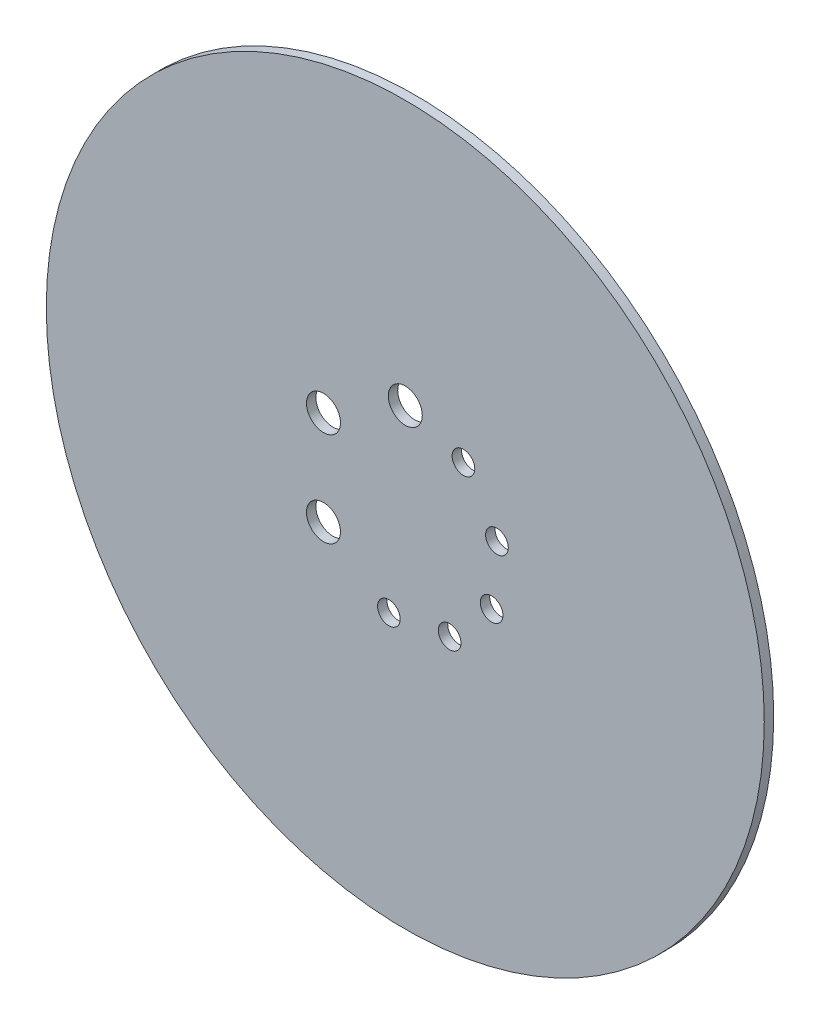
ISO-10303-21;
HEADER;
FILE_DESCRIPTION(('STEP AP214'),'2;1');
FILE_NAME('part.step','',(''),(''),'','','');
FILE_SCHEMA(('AUTOMOTIVE_DESIGN { 1 0 10303 214 1 1 1 1 }'));
ENDSEC;
DATA;
#1=APPLICATION_CONTEXT('core data for automotive mechanical design processes');
#2=APPLICATION_PROTOCOL_DEFINITION('international standard','automotive_design',2000,#1);
#3=PRODUCT_CONTEXT('',#1,'mechanical');
#4=PRODUCT('Part','Part','',(#3));
#5=PRODUCT_RELATED_PRODUCT_CATEGORY('part','',(#4));
#6=PRODUCT_DEFINITION_FORMATION('','',#4);
#7=PRODUCT_DEFINITION_CONTEXT('part definition',#1,'design');
#8=PRODUCT_DEFINITION('design','',#6,#7);
#9=PRODUCT_DEFINITION_SHAPE('','',#8);
#10=(LENGTH_UNIT() NAMED_UNIT(*) SI_UNIT(.MILLI.,.METRE.));
#11=(NAMED_UNIT(*) PLANE_ANGLE_UNIT() SI_UNIT($,.RADIAN.));
#12=(NAMED_UNIT(*) SI_UNIT($,.STERADIAN.) SOLID_ANGLE_UNIT());
#13=UNCERTAINTY_MEASURE_WITH_UNIT(LENGTH_MEASURE(1.E-05),#10,'distance_accuracy_value','');
#14=(GEOMETRIC_REPRESENTATION_CONTEXT(3) GLOBAL_UNCERTAINTY_ASSIGNED_CONTEXT((#13)) GLOBAL_UNIT_ASSIGNED_CONTEXT((#10,
#11,#12)) REPRESENTATION_CONTEXT('',''));
#15=CARTESIAN_POINT('',(0.,0.,0.));
#16=DIRECTION('',(0.,0.,1.));
#17=DIRECTION('',(1.,0.,0.));
#18=AXIS2_PLACEMENT_3D('',#15,#16,#17);
#19=CARTESIAN_POINT('',(0.,0.,5.));
#20=DIRECTION('',(0.,0.,-1.));
#21=DIRECTION('',(-1.,0.,0.));
#22=AXIS2_PLACEMENT_3D('',#19,#20,#21);
#23=CYLINDRICAL_SURFACE('',#22,190.);
#24=CARTESIAN_POINT('',(0.,0.,5.));
#25=DIRECTION('',(0.,0.,1.));
#26=DIRECTION('',(1.,0.,0.));
#27=AXIS2_PLACEMENT_3D('',#24,#25,#26);
#28=CIRCLE('',#27,190.);
#29=CARTESIAN_POINT('',(190.,0.,5.));
#30=VERTEX_POINT('',#29);
#31=EDGE_CURVE('E10',#30,#30,#28,.T.);
#32=ORIENTED_EDGE('',*,*,#31,.F.);
#33=EDGE_LOOP('',(#32));
#34=FACE_BOUND('',#33,.T.);
#35=CARTESIAN_POINT('',(0.,0.,0.));
#36=DIRECTION('',(0.,0.,1.));
#37=DIRECTION('',(1.,0.,0.));
#38=AXIS2_PLACEMENT_3D('',#35,#36,#37);
#39=CIRCLE('',#38,190.);
#40=CARTESIAN_POINT('',(190.,0.,0.));
#41=VERTEX_POINT('',#40);
#42=EDGE_CURVE('E40',#41,#41,#39,.T.);
#43=ORIENTED_EDGE('',*,*,#42,.T.);
#44=EDGE_LOOP('',(#43));
#45=FACE_BOUND('',#44,.T.);
#46=ADVANCED_FACE('F37',(#34,#45),#23,.T.);
#47=CARTESIAN_POINT('',(0.,0.,5.));
#48=DIRECTION('',(0.,0.,1.));
#49=DIRECTION('',(1.,0.,0.));
#50=AXIS2_PLACEMENT_3D('',#47,#48,#49);
#51=PLANE('',#50);
#52=CARTESIAN_POINT('',(-43.3012701892218,25.0000000000002,5.));
#53=DIRECTION('',(0.,0.,1.));
#54=DIRECTION('',(1.,0.,0.));
#55=AXIS2_PLACEMENT_3D('',#52,#53,#54);
#56=CIRCLE('',#55,9.00000000000001);
#57=CARTESIAN_POINT('',(-34.3012701892218,25.0000000000002,5.));
#58=VERTEX_POINT('',#57);
#59=EDGE_CURVE('E47',#58,#58,#56,.T.);
#60=ORIENTED_EDGE('',*,*,#59,.F.);
#61=EDGE_LOOP('',(#60));
#62=FACE_BOUND('',#61,.T.);
#63=CARTESIAN_POINT('',(-43.301270189222,-24.9999999999999,5.));
#64=DIRECTION('',(0.,0.,1.));
#65=DIRECTION('',(1.,0.,0.));
#66=AXIS2_PLACEMENT_3D('',#63,#64,#65);
#67=CIRCLE('',#66,9.);
#68=CARTESIAN_POINT('',(-34.301270189222,-24.9999999999999,5.));
#69=VERTEX_POINT('',#68);
#70=EDGE_CURVE('E51',#69,#69,#67,.T.);
#71=ORIENTED_EDGE('',*,*,#70,.F.);
#72=EDGE_LOOP('',(#71));
#73=FACE_BOUND('',#72,.T.);
#74=CARTESIAN_POINT('',(30.7830737662827,39.4005376803363,5.));
#75=DIRECTION('',(0.,0.,1.));
#76=DIRECTION('',(1.,0.,0.));
#77=AXIS2_PLACEMENT_3D('',#74,#75,#76);
#78=CIRCLE('',#77,5.99999999999999);
#79=CARTESIAN_POINT('',(36.7830737662827,39.4005376803363,5.));
#80=VERTEX_POINT('',#79);
#81=EDGE_CURVE('E55',#80,#80,#78,.T.);
#82=ORIENTED_EDGE('',*,*,#81,.F.);
#83=EDGE_LOOP('',(#82));
#84=FACE_BOUND('',#83,.T.);
#85=CARTESIAN_POINT('',(48.5147863137998,12.0960947799836,5.));
#86=DIRECTION('',(0.,0.,1.));
#87=DIRECTION('',(1.,0.,0.));
#88=AXIS2_PLACEMENT_3D('',#85,#86,#87);
#89=CIRCLE('',#88,5.99999999999999);
#90=CARTESIAN_POINT('',(54.5147863137998,12.0960947799836,5.));
#91=VERTEX_POINT('',#90);
#92=EDGE_CURVE('E58',#91,#91,#89,.T.);
#93=ORIENTED_EDGE('',*,*,#92,.F.);
#94=EDGE_LOOP('',(#93));
#95=FACE_BOUND('',#94,.T.);
#96=CARTESIAN_POINT('',(45.6772728821301,-20.3368321537899,5.));
#97=DIRECTION('',(0.,0.,1.));
#98=DIRECTION('',(1.,0.,0.));
#99=AXIS2_PLACEMENT_3D('',#96,#97,#98);
#100=CIRCLE('',#99,5.99999999999999);
#101=CARTESIAN_POINT('',(51.6772728821301,-20.3368321537899,5.));
#102=VERTEX_POINT('',#101);
#103=EDGE_CURVE('E61',#102,#102,#100,.T.);
#104=ORIENTED_EDGE('',*,*,#103,.F.);
#105=EDGE_LOOP('',(#104));
#106=FACE_BOUND('',#105,.T.);
#107=CARTESIAN_POINT('',(23.4735781392946,-44.1473796429463,5.));
#108=DIRECTION('',(0.,0.,1.));
#109=DIRECTION('',(1.,0.,0.));
#110=AXIS2_PLACEMENT_3D('',#107,#108,#109);
#111=CIRCLE('',#110,6.);
#112=CARTESIAN_POINT('',(29.4735781392946,-44.1473796429463,5.));
#113=VERTEX_POINT('',#112);
#114=EDGE_CURVE('E64',#113,#113,#111,.T.);
#115=ORIENTED_EDGE('',*,*,#114,.F.);
#116=EDGE_LOOP('',(#115));
#117=FACE_BOUND('',#116,.T.);
#118=CARTESIAN_POINT('',(-8.68240888334655,-49.2403876506104,5.));
#119=DIRECTION('',(0.,0.,1.));
#120=DIRECTION('',(1.,0.,0.));
#121=AXIS2_PLACEMENT_3D('',#118,#119,#120);
#122=CIRCLE('',#121,5.99999999999999);
#123=CARTESIAN_POINT('',(-2.68240888334656,-49.2403876506104,5.));
#124=VERTEX_POINT('',#123);
#125=EDGE_CURVE('E67',#124,#124,#122,.T.);
#126=ORIENTED_EDGE('',*,*,#125,.F.);
#127=EDGE_LOOP('',(#126));
#128=FACE_BOUND('',#127,.T.);
#129=CARTESIAN_POINT('',(0.,50.,5.));
#130=DIRECTION('',(0.,0.,1.));
#131=DIRECTION('',(1.,0.,0.));
#132=AXIS2_PLACEMENT_3D('',#129,#130,#131);
#133=CIRCLE('',#132,9.);
#134=CARTESIAN_POINT('',(8.99999999999999,50.,5.));
#135=VERTEX_POINT('',#134);
#136=EDGE_CURVE('E70',#135,#135,#133,.T.);
#137=ORIENTED_EDGE('',*,*,#136,.F.);
#138=EDGE_LOOP('',(#137));
#139=FACE_BOUND('',#138,.T.);
#140=ORIENTED_EDGE('',*,*,#31,.T.);
#141=EDGE_LOOP('',(#140));
#142=FACE_BOUND('',#141,.T.);
#143=ADVANCED_FACE('F105',(#62,#73,#84,#95,#106,#117,#128,#139,#142),#51,.T.);
#144=CARTESIAN_POINT('',(0.,0.,0.));
#145=DIRECTION('',(0.,0.,1.));
#146=DIRECTION('',(1.,0.,0.));
#147=AXIS2_PLACEMENT_3D('',#144,#145,#146);
#148=PLANE('',#147);
#149=CARTESIAN_POINT('',(-43.3012701892218,25.0000000000002,0.));
#150=DIRECTION('',(0.,0.,-1.));
#151=DIRECTION('',(-1.,0.,0.));
#152=AXIS2_PLACEMENT_3D('',#149,#150,#151);
#153=CIRCLE('',#152,9.00000000000001);
#154=CARTESIAN_POINT('',(-52.3012701892218,25.0000000000002,0.));
#155=VERTEX_POINT('',#154);
#156=EDGE_CURVE('E76',#155,#155,#153,.T.);
#157=ORIENTED_EDGE('',*,*,#156,.F.);
#158=EDGE_LOOP('',(#157));
#159=FACE_BOUND('',#158,.T.);
#160=CARTESIAN_POINT('',(-43.301270189222,-24.9999999999999,0.));
#161=DIRECTION('',(0.,0.,-1.));
#162=DIRECTION('',(-1.,0.,0.));
#163=AXIS2_PLACEMENT_3D('',#160,#161,#162);
#164=CIRCLE('',#163,9.);
#165=CARTESIAN_POINT('',(-52.301270189222,-24.9999999999999,0.));
#166=VERTEX_POINT('',#165);
#167=EDGE_CURVE('E84',#166,#166,#164,.T.);
#168=ORIENTED_EDGE('',*,*,#167,.F.);
#169=EDGE_LOOP('',(#168));
#170=FACE_BOUND('',#169,.T.);
#171=CARTESIAN_POINT('',(30.7830737662827,39.4005376803363,0.));
#172=DIRECTION('',(0.,0.,-1.));
#173=DIRECTION('',(-1.,0.,0.));
#174=AXIS2_PLACEMENT_3D('',#171,#172,#173);
#175=CIRCLE('',#174,5.99999999999999);
#176=CARTESIAN_POINT('',(24.7830737662827,39.4005376803363,0.));
#177=VERTEX_POINT('',#176);
#178=EDGE_CURVE('E80',#177,#177,#175,.T.);
#179=ORIENTED_EDGE('',*,*,#178,.F.);
#180=EDGE_LOOP('',(#179));
#181=FACE_BOUND('',#180,.T.);
#182=CARTESIAN_POINT('',(48.5147863137998,12.0960947799836,0.));
#183=DIRECTION('',(0.,0.,-1.));
#184=DIRECTION('',(-1.,0.,0.));
#185=AXIS2_PLACEMENT_3D('',#182,#183,#184);
#186=CIRCLE('',#185,5.99999999999999);
#187=CARTESIAN_POINT('',(42.5147863137998,12.0960947799836,0.));
#188=VERTEX_POINT('',#187);
#189=EDGE_CURVE('E77',#188,#188,#186,.T.);
#190=ORIENTED_EDGE('',*,*,#189,.F.);
#191=EDGE_LOOP('',(#190));
#192=FACE_BOUND('',#191,.T.);
#193=CARTESIAN_POINT('',(45.6772728821301,-20.3368321537899,0.));
#194=DIRECTION('',(0.,0.,-1.));
#195=DIRECTION('',(-1.,0.,0.));
#196=AXIS2_PLACEMENT_3D('',#193,#194,#195);
#197=CIRCLE('',#196,5.99999999999999);
#198=CARTESIAN_POINT('',(39.6772728821301,-20.3368321537899,0.));
#199=VERTEX_POINT('',#198);
#200=EDGE_CURVE('E81',#199,#199,#197,.T.);
#201=ORIENTED_EDGE('',*,*,#200,.F.);
#202=EDGE_LOOP('',(#201));
#203=FACE_BOUND('',#202,.T.);
#204=CARTESIAN_POINT('',(23.4735781392946,-44.1473796429463,0.));
#205=DIRECTION('',(0.,0.,-1.));
#206=DIRECTION('',(-1.,0.,0.));
#207=AXIS2_PLACEMENT_3D('',#204,#205,#206);
#208=CIRCLE('',#207,6.);
#209=CARTESIAN_POINT('',(17.4735781392946,-44.1473796429463,0.));
#210=VERTEX_POINT('',#209);
#211=EDGE_CURVE('E93',#210,#210,#208,.T.);
#212=ORIENTED_EDGE('',*,*,#211,.F.);
#213=EDGE_LOOP('',(#212));
#214=FACE_BOUND('',#213,.T.);
#215=CARTESIAN_POINT('',(-8.68240888334655,-49.2403876506104,0.));
#216=DIRECTION('',(0.,0.,-1.));
#217=DIRECTION('',(-1.,0.,0.));
#218=AXIS2_PLACEMENT_3D('',#215,#216,#217);
#219=CIRCLE('',#218,5.99999999999999);
#220=CARTESIAN_POINT('',(-14.6824088833465,-49.2403876506104,0.));
#221=VERTEX_POINT('',#220);
#222=EDGE_CURVE('E90',#221,#221,#219,.T.);
#223=ORIENTED_EDGE('',*,*,#222,.F.);
#224=EDGE_LOOP('',(#223));
#225=FACE_BOUND('',#224,.T.);
#226=CARTESIAN_POINT('',(0.,50.,0.));
#227=DIRECTION('',(0.,0.,-1.));
#228=DIRECTION('',(-1.,0.,0.));
#229=AXIS2_PLACEMENT_3D('',#226,#227,#228);
#230=CIRCLE('',#229,9.);
#231=CARTESIAN_POINT('',(-9.,50.,0.));
#232=VERTEX_POINT('',#231);
#233=EDGE_CURVE('E73',#232,#232,#230,.T.);
#234=ORIENTED_EDGE('',*,*,#233,.F.);
#235=EDGE_LOOP('',(#234));
#236=FACE_BOUND('',#235,.T.);
#237=ORIENTED_EDGE('',*,*,#42,.F.);
#238=EDGE_LOOP('',(#237));
#239=FACE_BOUND('',#238,.T.);
#240=ADVANCED_FACE('F101',(#159,#170,#181,#192,#203,#214,#225,#236,#239),#148,.F.);
#241=CARTESIAN_POINT('',(0.,50.,10.));
#242=DIRECTION('',(0.,0.,-1.));
#243=DIRECTION('',(-1.,0.,0.));
#244=AXIS2_PLACEMENT_3D('',#241,#242,#243);
#245=CYLINDRICAL_SURFACE('',#244,9.);
#246=ORIENTED_EDGE('',*,*,#136,.T.);
#247=EDGE_LOOP('',(#246));
#248=FACE_BOUND('',#247,.T.);
#249=ORIENTED_EDGE('',*,*,#233,.T.);
#250=EDGE_LOOP('',(#249));
#251=FACE_BOUND('',#250,.T.);
#252=ADVANCED_FACE('F104',(#248,#251),#245,.F.);
#253=CARTESIAN_POINT('',(-8.68240888334655,-49.2403876506104,10.));
#254=DIRECTION('',(0.,0.,-1.));
#255=DIRECTION('',(-1.,0.,0.));
#256=AXIS2_PLACEMENT_3D('',#253,#254,#255);
#257=CYLINDRICAL_SURFACE('',#256,5.99999999999999);
#258=ORIENTED_EDGE('',*,*,#125,.T.);
#259=EDGE_LOOP('',(#258));
#260=FACE_BOUND('',#259,.T.);
#261=ORIENTED_EDGE('',*,*,#222,.T.);
#262=EDGE_LOOP('',(#261));
#263=FACE_BOUND('',#262,.T.);
#264=ADVANCED_FACE('F129',(#260,#263),#257,.F.);
#265=CARTESIAN_POINT('',(23.4735781392946,-44.1473796429463,10.));
#266=DIRECTION('',(0.,0.,-1.));
#267=DIRECTION('',(-1.,0.,0.));
#268=AXIS2_PLACEMENT_3D('',#265,#266,#267);
#269=CYLINDRICAL_SURFACE('',#268,6.);
#270=ORIENTED_EDGE('',*,*,#114,.T.);
#271=EDGE_LOOP('',(#270));
#272=FACE_BOUND('',#271,.T.);
#273=ORIENTED_EDGE('',*,*,#211,.T.);
#274=EDGE_LOOP('',(#273));
#275=FACE_BOUND('',#274,.T.);
#276=ADVANCED_FACE('F149',(#272,#275),#269,.F.);
#277=CARTESIAN_POINT('',(45.6772728821301,-20.3368321537899,10.));
#278=DIRECTION('',(0.,0.,-1.));
#279=DIRECTION('',(-1.,0.,0.));
#280=AXIS2_PLACEMENT_3D('',#277,#278,#279);
#281=CYLINDRICAL_SURFACE('',#280,5.99999999999999);
#282=ORIENTED_EDGE('',*,*,#103,.T.);
#283=EDGE_LOOP('',(#282));
#284=FACE_BOUND('',#283,.T.);
#285=ORIENTED_EDGE('',*,*,#200,.T.);
#286=EDGE_LOOP('',(#285));
#287=FACE_BOUND('',#286,.T.);
#288=ADVANCED_FACE('F99',(#284,#287),#281,.F.);
#289=CARTESIAN_POINT('',(48.5147863137998,12.0960947799836,10.));
#290=DIRECTION('',(0.,0.,-1.));
#291=DIRECTION('',(-1.,0.,0.));
#292=AXIS2_PLACEMENT_3D('',#289,#290,#291);
#293=CYLINDRICAL_SURFACE('',#292,5.99999999999999);
#294=ORIENTED_EDGE('',*,*,#92,.T.);
#295=EDGE_LOOP('',(#294));
#296=FACE_BOUND('',#295,.T.);
#297=ORIENTED_EDGE('',*,*,#189,.T.);
#298=EDGE_LOOP('',(#297));
#299=FACE_BOUND('',#298,.T.);
#300=ADVANCED_FACE('F131',(#296,#299),#293,.F.);
#301=CARTESIAN_POINT('',(30.7830737662827,39.4005376803363,10.));
#302=DIRECTION('',(0.,0.,-1.));
#303=DIRECTION('',(-1.,0.,0.));
#304=AXIS2_PLACEMENT_3D('',#301,#302,#303);
#305=CYLINDRICAL_SURFACE('',#304,5.99999999999999);
#306=ORIENTED_EDGE('',*,*,#81,.T.);
#307=EDGE_LOOP('',(#306));
#308=FACE_BOUND('',#307,.T.);
#309=ORIENTED_EDGE('',*,*,#178,.T.);
#310=EDGE_LOOP('',(#309));
#311=FACE_BOUND('',#310,.T.);
#312=ADVANCED_FACE('F134',(#308,#311),#305,.F.);
#313=CARTESIAN_POINT('',(-43.301270189222,-24.9999999999999,10.));
#314=DIRECTION('',(0.,0.,-1.));
#315=DIRECTION('',(-1.,0.,0.));
#316=AXIS2_PLACEMENT_3D('',#313,#314,#315);
#317=CYLINDRICAL_SURFACE('',#316,9.);
#318=ORIENTED_EDGE('',*,*,#70,.T.);
#319=EDGE_LOOP('',(#318));
#320=FACE_BOUND('',#319,.T.);
#321=ORIENTED_EDGE('',*,*,#167,.T.);
#322=EDGE_LOOP('',(#321));
#323=FACE_BOUND('',#322,.T.);
#324=ADVANCED_FACE('F138',(#320,#323),#317,.F.);
#325=CARTESIAN_POINT('',(-43.3012701892218,25.0000000000002,10.));
#326=DIRECTION('',(0.,0.,-1.));
#327=DIRECTION('',(-1.,0.,0.));
#328=AXIS2_PLACEMENT_3D('',#325,#326,#327);
#329=CYLINDRICAL_SURFACE('',#328,9.00000000000001);
#330=ORIENTED_EDGE('',*,*,#59,.T.);
#331=EDGE_LOOP('',(#330));
#332=FACE_BOUND('',#331,.T.);
#333=ORIENTED_EDGE('',*,*,#156,.T.);
#334=EDGE_LOOP('',(#333));
#335=FACE_BOUND('',#334,.T.);
#336=ADVANCED_FACE('F142',(#332,#335),#329,.F.);
#337=CLOSED_SHELL('',(#46,#143,#240,#252,#264,#276,#288,#300,#312,#324,#336));
#338=MANIFOLD_SOLID_BREP('B2',#337);
#339=ADVANCED_BREP_SHAPE_REPRESENTATION('',(#18,#338),#14);
#340=SHAPE_DEFINITION_REPRESENTATION(#9,#339);
ENDSEC;
END-ISO-10303-21;
